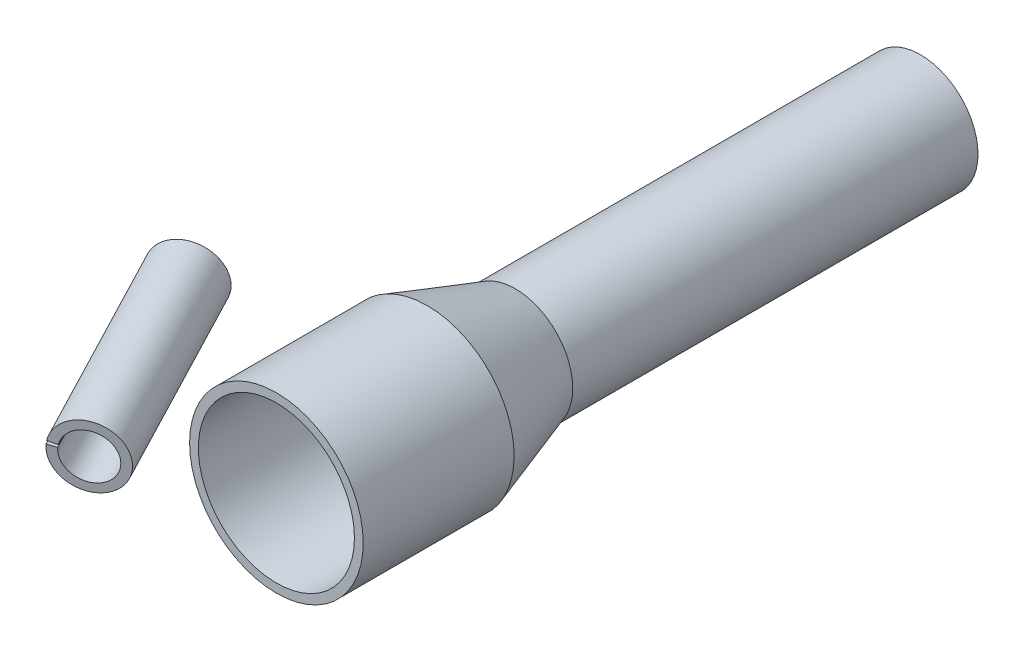
ISO-10303-21;
HEADER;
FILE_DESCRIPTION(('STEP AP214'),'2;1');
FILE_NAME('part.step','',(''),(''),'','','');
FILE_SCHEMA(('AUTOMOTIVE_DESIGN { 1 0 10303 214 1 1 1 1 }'));
ENDSEC;
DATA;
#1=APPLICATION_CONTEXT('core data for automotive mechanical design processes');
#2=APPLICATION_PROTOCOL_DEFINITION('international standard','automotive_design',2000,#1);
#3=PRODUCT_CONTEXT('',#1,'mechanical');
#4=PRODUCT('Part','Part','',(#3));
#5=PRODUCT_RELATED_PRODUCT_CATEGORY('part','',(#4));
#6=PRODUCT_DEFINITION_FORMATION('','',#4);
#7=PRODUCT_DEFINITION_CONTEXT('part definition',#1,'design');
#8=PRODUCT_DEFINITION('design','',#6,#7);
#9=PRODUCT_DEFINITION_SHAPE('','',#8);
#10=(LENGTH_UNIT() NAMED_UNIT(*) SI_UNIT(.MILLI.,.METRE.));
#11=(NAMED_UNIT(*) PLANE_ANGLE_UNIT() SI_UNIT($,.RADIAN.));
#12=(NAMED_UNIT(*) SI_UNIT($,.STERADIAN.) SOLID_ANGLE_UNIT());
#13=UNCERTAINTY_MEASURE_WITH_UNIT(LENGTH_MEASURE(1.E-05),#10,'distance_accuracy_value','');
#14=(GEOMETRIC_REPRESENTATION_CONTEXT(3) GLOBAL_UNCERTAINTY_ASSIGNED_CONTEXT((#13)) GLOBAL_UNIT_ASSIGNED_CONTEXT((#10,
#11,#12)) REPRESENTATION_CONTEXT('',''));
#15=CARTESIAN_POINT('',(0.,0.,0.));
#16=DIRECTION('',(0.,0.,1.));
#17=DIRECTION('',(1.,0.,0.));
#18=AXIS2_PLACEMENT_3D('',#15,#16,#17);
#19=CARTESIAN_POINT('',(0.,0.,51.3831032035715));
#20=DIRECTION('',(0.431711304054737,-0.0761223507816861,0.898794046299166));
#21=DIRECTION('',(0.901409499971671,0.,-0.432967566176523));
#22=AXIS2_PLACEMENT_3D('',#19,#20,#21);
#23=CYLINDRICAL_SURFACE('',#22,2.68999999999999);
#24=CARTESIAN_POINT('',(-22.4670726967806,3.96155109398092,4.60816127368262));
#25=DIRECTION('',(0.431711304054737,-0.0761223507816861,0.898794046299166));
#26=DIRECTION('',(0.901409499971671,0.,-0.432967566176523));
#27=AXIS2_PLACEMENT_3D('',#24,#25,#26);
#28=CIRCLE('',#27,2.68999999999998);
#29=CARTESIAN_POINT('',(-24.8692812602837,4.2421697388783,5.78576358073202));
#30=VERTEX_POINT('',#29);
#31=CARTESIAN_POINT('',(-24.8203875866409,4.51945954130341,5.78576358073202));
#32=VERTEX_POINT('',#31);
#33=EDGE_CURVE('E12',#30,#32,#28,.T.);
#34=ORIENTED_EDGE('',*,*,#33,.F.);
#35=DIRECTION('',(0.431711304054737,-0.0761223507816861,0.898794046299166));
#36=VECTOR('',#35,1.);
#37=CARTESIAN_POINT('',(-24.8692812602837,4.2421697388783,5.78576358073202));
#38=LINE('',#37,#36);
#39=CARTESIAN_POINT('',(-14.50820996297,2.41523332011783,27.356820691912));
#40=VERTEX_POINT('',#39);
#41=EDGE_CURVE('E84',#30,#40,#38,.T.);
#42=ORIENTED_EDGE('',*,*,#41,.T.);
#43=CARTESIAN_POINT('',(-12.1060013994669,2.13461467522045,26.1792183848626));
#44=DIRECTION('',(0.431711304054737,-0.0761223507816861,0.898794046299166));
#45=DIRECTION('',(0.901409499971671,0.,-0.432967566176523));
#46=AXIS2_PLACEMENT_3D('',#43,#44,#45);
#47=CIRCLE('',#46,2.69);
#48=CARTESIAN_POINT('',(-14.4593162893272,2.69252312254295,27.356820691912));
#49=VERTEX_POINT('',#48);
#50=EDGE_CURVE('E79',#40,#49,#47,.T.);
#51=ORIENTED_EDGE('',*,*,#50,.T.);
#52=DIRECTION('',(0.431711304054737,-0.0761223507816861,0.898794046299166));
#53=VECTOR('',#52,1.);
#54=CARTESIAN_POINT('',(-24.8203875866409,4.51945954130341,5.78576358073202));
#55=LINE('',#54,#53);
#56=EDGE_CURVE('E82',#32,#49,#55,.T.);
#57=ORIENTED_EDGE('',*,*,#56,.F.);
#58=EDGE_LOOP('',(#34,#42,#51,#57));
#59=FACE_BOUND('',#58,.T.);
#60=ADVANCED_FACE('F43',(#59),#23,.F.);
#61=CARTESIAN_POINT('',(-24.8692812602837,4.2421697388783,5.78576358073202));
#62=DIRECTION('',(0.431711304054737,-0.0761223507816861,0.898794046299166));
#63=DIRECTION('',(0.901409499971671,0.,-0.432967566176523));
#64=AXIS2_PLACEMENT_3D('',#61,#62,#63);
#65=PLANE('',#64);
#66=CARTESIAN_POINT('',(-22.4670726967806,3.96155109398092,4.60816127368262));
#67=DIRECTION('',(0.431711304054737,-0.0761223507816861,0.898794046299166));
#68=DIRECTION('',(0.901409499971671,0.,-0.432967566176523));
#69=AXIS2_PLACEMENT_3D('',#66,#67,#68);
#70=CIRCLE('',#69,3.69);
#71=CARTESIAN_POINT('',(-25.7622955961585,4.34648893772491,6.22353395509983));
#72=VERTEX_POINT('',#71);
#73=CARTESIAN_POINT('',(-25.6952258356596,4.72686045108872,6.22353395509983));
#74=VERTEX_POINT('',#73);
#75=EDGE_CURVE('E51',#72,#74,#70,.T.);
#76=ORIENTED_EDGE('',*,*,#75,.F.);
#77=DIRECTION('',(-0.893014335874779,0.104319198846609,0.437770374367807));
#78=VECTOR('',#77,1.);
#79=CARTESIAN_POINT('',(-24.8692812602837,4.2421697388783,5.78576358073202));
#80=LINE('',#79,#78);
#81=EDGE_CURVE('E89',#30,#72,#80,.T.);
#82=ORIENTED_EDGE('',*,*,#81,.F.);
#83=ORIENTED_EDGE('',*,*,#33,.T.);
#84=DIRECTION('',(-0.874838249018695,0.207400909785313,0.437770374367807));
#85=VECTOR('',#84,1.);
#86=CARTESIAN_POINT('',(-24.8203875866409,4.51945954130341,5.78576358073202));
#87=LINE('',#86,#85);
#88=EDGE_CURVE('E101',#32,#74,#87,.T.);
#89=ORIENTED_EDGE('',*,*,#88,.T.);
#90=EDGE_LOOP('',(#76,#82,#83,#89));
#91=FACE_BOUND('',#90,.T.);
#92=ADVANCED_FACE('F45',(#91),#65,.F.);
#93=CARTESIAN_POINT('',(0.,0.,51.3831032035715));
#94=DIRECTION('',(0.431711304054737,-0.0761223507816861,0.898794046299166));
#95=DIRECTION('',(0.901409499971671,0.,-0.432967566176523));
#96=AXIS2_PLACEMENT_3D('',#93,#94,#95);
#97=CYLINDRICAL_SURFACE('',#96,3.69);
#98=CARTESIAN_POINT('',(-12.1060013994669,2.13461467522045,26.1792183848626));
#99=DIRECTION('',(0.431711304054737,-0.0761223507816861,0.898794046299166));
#100=DIRECTION('',(0.901409499971671,0.,-0.432967566176523));
#101=AXIS2_PLACEMENT_3D('',#98,#99,#100);
#102=CIRCLE('',#101,3.69);
#103=CARTESIAN_POINT('',(-15.4012242988448,2.51955251896444,27.7945910662798));
#104=VERTEX_POINT('',#103);
#105=CARTESIAN_POINT('',(-15.3341545383459,2.89992403232826,27.7945910662798));
#106=VERTEX_POINT('',#105);
#107=EDGE_CURVE('E88',#104,#106,#102,.T.);
#108=ORIENTED_EDGE('',*,*,#107,.F.);
#109=DIRECTION('',(0.431711304054737,-0.0761223507816861,0.898794046299166));
#110=VECTOR('',#109,1.);
#111=CARTESIAN_POINT('',(-25.7622955961585,4.34648893772491,6.22353395509983));
#112=LINE('',#111,#110);
#113=EDGE_CURVE('E109',#72,#104,#112,.T.);
#114=ORIENTED_EDGE('',*,*,#113,.F.);
#115=ORIENTED_EDGE('',*,*,#75,.T.);
#116=DIRECTION('',(0.431711304054737,-0.0761223507816861,0.898794046299167));
#117=VECTOR('',#116,1.);
#118=CARTESIAN_POINT('',(-25.6952258356596,4.72686045108872,6.22353395509983));
#119=LINE('',#118,#117);
#120=EDGE_CURVE('E97',#74,#106,#119,.T.);
#121=ORIENTED_EDGE('',*,*,#120,.T.);
#122=EDGE_LOOP('',(#108,#114,#115,#121));
#123=FACE_BOUND('',#122,.T.);
#124=ADVANCED_FACE('F115',(#123),#97,.T.);
#125=CARTESIAN_POINT('',(-15.4012242988448,2.51955251896444,27.7945910662798));
#126=DIRECTION('',(-0.431711304054737,0.0761223507816861,-0.898794046299166));
#127=DIRECTION('',(-0.901409499971671,0.,0.432967566176523));
#128=AXIS2_PLACEMENT_3D('',#125,#126,#127);
#129=PLANE('',#128);
#130=DIRECTION('',(0.893014335874774,-0.104319198846608,-0.437770374367817));
#131=VECTOR('',#130,1.);
#132=CARTESIAN_POINT('',(-15.4012242988448,2.51955251896444,27.7945910662798));
#133=LINE('',#132,#131);
#134=EDGE_CURVE('E107',#104,#40,#133,.T.);
#135=ORIENTED_EDGE('',*,*,#134,.F.);
#136=ORIENTED_EDGE('',*,*,#107,.T.);
#137=DIRECTION('',(0.87483824901869,-0.207400909785312,-0.437770374367817));
#138=VECTOR('',#137,1.);
#139=CARTESIAN_POINT('',(-15.3341545383459,2.89992403232826,27.7945910662798));
#140=LINE('',#139,#138);
#141=EDGE_CURVE('E92',#106,#49,#140,.T.);
#142=ORIENTED_EDGE('',*,*,#141,.T.);
#143=ORIENTED_EDGE('',*,*,#50,.F.);
#144=EDGE_LOOP('',(#135,#136,#142,#143));
#145=FACE_BOUND('',#144,.T.);
#146=ADVANCED_FACE('F93',(#145),#129,.F.);
#147=CARTESIAN_POINT('',(-40.0526802864188,5.86532175491951,19.7349737578354));
#148=DIRECTION('',(0.127085584837487,0.991626387538912,0.0229425731565194));
#149=DIRECTION('',(0.779491268320961,-0.114148842503382,0.615924836620928));
#150=AXIS2_PLACEMENT_3D('',#147,#148,#149);
#151=PLANE('',#150);
#152=ORIENTED_EDGE('',*,*,#41,.F.);
#153=ORIENTED_EDGE('',*,*,#81,.T.);
#154=ORIENTED_EDGE('',*,*,#113,.T.);
#155=ORIENTED_EDGE('',*,*,#134,.T.);
#156=EDGE_LOOP('',(#152,#153,#154,#155));
#157=FACE_BOUND('',#156,.T.);
#158=ADVANCED_FACE('F117',(#157),#151,.T.);
#159=CARTESIAN_POINT('',(-39.6432662951137,8.18722388050526,19.7349737578354));
#160=DIRECTION('',(0.219734812911526,0.975289828887646,-0.0229425731565194));
#161=DIRECTION('',(0.771523396281722,-0.159336890340562,0.615924836620928));
#162=AXIS2_PLACEMENT_3D('',#159,#160,#161);
#163=PLANE('',#162);
#164=ORIENTED_EDGE('',*,*,#56,.T.);
#165=ORIENTED_EDGE('',*,*,#141,.F.);
#166=ORIENTED_EDGE('',*,*,#120,.F.);
#167=ORIENTED_EDGE('',*,*,#88,.F.);
#168=EDGE_LOOP('',(#164,#165,#166,#167));
#169=FACE_BOUND('',#168,.T.);
#170=ADVANCED_FACE('F100',(#169),#163,.F.);
#171=CLOSED_SHELL('',(#60,#92,#124,#146,#158,#170));
#172=MANIFOLD_SOLID_BREP('B2',#171);
#173=CARTESIAN_POINT('',(0.,0.,-83.5827742070717));
#174=DIRECTION('',(0.,0.,1.));
#175=DIRECTION('',(1.,0.,0.));
#176=AXIS2_PLACEMENT_3D('',#173,#174,#175);
#177=CYLINDRICAL_SURFACE('',#176,9.87499999999999);
#178=CARTESIAN_POINT('',(0.,0.,17.));
#179=DIRECTION('',(0.,0.,1.));
#180=DIRECTION('',(1.,0.,0.));
#181=AXIS2_PLACEMENT_3D('',#178,#179,#180);
#182=CIRCLE('',#181,9.87499999999999);
#183=CARTESIAN_POINT('',(9.87499999999999,0.,17.));
#184=VERTEX_POINT('',#183);
#185=EDGE_CURVE('E195',#184,#184,#182,.T.);
#186=ORIENTED_EDGE('',*,*,#185,.F.);
#187=EDGE_LOOP('',(#186));
#188=FACE_BOUND('',#187,.T.);
#189=CARTESIAN_POINT('',(0.,0.,-0.162354632309084));
#190=DIRECTION('',(0.,0.,1.));
#191=DIRECTION('',(1.,0.,0.));
#192=AXIS2_PLACEMENT_3D('',#189,#190,#191);
#193=CIRCLE('',#192,9.87499999999999);
#194=CARTESIAN_POINT('',(9.87499999999999,0.,-0.162354632309084));
#195=VERTEX_POINT('',#194);
#196=EDGE_CURVE('E42',#195,#195,#193,.T.);
#197=ORIENTED_EDGE('',*,*,#196,.T.);
#198=EDGE_LOOP('',(#197));
#199=FACE_BOUND('',#198,.T.);
#200=ADVANCED_FACE('F167',(#188,#199),#177,.T.);
#201=CARTESIAN_POINT('',(0.,0.,-10.1623546323091));
#202=DIRECTION('',(0.,0.,1.));
#203=DIRECTION('',(1.,0.,0.));
#204=AXIS2_PLACEMENT_3D('',#201,#202,#203);
#205=CONICAL_SURFACE('',#204,6.53999999999999,0.321900546895892);
#206=ORIENTED_EDGE('',*,*,#196,.F.);
#207=EDGE_LOOP('',(#206));
#208=FACE_BOUND('',#207,.T.);
#209=CARTESIAN_POINT('',(0.,0.,-10.1623546323091));
#210=DIRECTION('',(0.,0.,1.));
#211=DIRECTION('',(1.,0.,0.));
#212=AXIS2_PLACEMENT_3D('',#209,#210,#211);
#213=CIRCLE('',#212,6.53999999999999);
#214=CARTESIAN_POINT('',(6.53999999999999,0.,-10.1623546323091));
#215=VERTEX_POINT('',#214);
#216=EDGE_CURVE('E173',#215,#215,#213,.T.);
#217=ORIENTED_EDGE('',*,*,#216,.T.);
#218=EDGE_LOOP('',(#217));
#219=FACE_BOUND('',#218,.T.);
#220=ADVANCED_FACE('F203',(#208,#219),#205,.T.);
#221=CARTESIAN_POINT('',(0.,0.,-83.5827742070717));
#222=DIRECTION('',(0.,0.,1.));
#223=DIRECTION('',(1.,0.,0.));
#224=AXIS2_PLACEMENT_3D('',#221,#222,#223);
#225=CYLINDRICAL_SURFACE('',#224,6.53999999999999);
#226=ORIENTED_EDGE('',*,*,#216,.F.);
#227=EDGE_LOOP('',(#226));
#228=FACE_BOUND('',#227,.T.);
#229=CARTESIAN_POINT('',(0.,0.,-56.26));
#230=DIRECTION('',(0.,0.,1.));
#231=DIRECTION('',(1.,0.,0.));
#232=AXIS2_PLACEMENT_3D('',#229,#230,#231);
#233=CIRCLE('',#232,6.53999999999999);
#234=CARTESIAN_POINT('',(6.53999999999999,0.,-56.26));
#235=VERTEX_POINT('',#234);
#236=EDGE_CURVE('E177',#235,#235,#233,.T.);
#237=ORIENTED_EDGE('',*,*,#236,.T.);
#238=EDGE_LOOP('',(#237));
#239=FACE_BOUND('',#238,.T.);
#240=ADVANCED_FACE('F207',(#228,#239),#225,.T.);
#241=CARTESIAN_POINT('',(0.,6.53999999999999,-56.26));
#242=DIRECTION('',(0.,0.,-1.));
#243=DIRECTION('',(-1.,0.,0.));
#244=AXIS2_PLACEMENT_3D('',#241,#242,#243);
#245=PLANE('',#244);
#246=CARTESIAN_POINT('',(0.,0.,-56.26));
#247=DIRECTION('',(0.,0.,1.));
#248=DIRECTION('',(1.,0.,0.));
#249=AXIS2_PLACEMENT_3D('',#246,#247,#248);
#250=CIRCLE('',#249,5.53999999999999);
#251=CARTESIAN_POINT('',(5.53999999999999,0.,-56.26));
#252=VERTEX_POINT('',#251);
#253=EDGE_CURVE('E181',#252,#252,#250,.T.);
#254=ORIENTED_EDGE('',*,*,#253,.T.);
#255=EDGE_LOOP('',(#254));
#256=FACE_BOUND('',#255,.T.);
#257=ORIENTED_EDGE('',*,*,#236,.F.);
#258=EDGE_LOOP('',(#257));
#259=FACE_BOUND('',#258,.T.);
#260=ADVANCED_FACE('F212',(#256,#259),#245,.T.);
#261=CARTESIAN_POINT('',(0.,0.,-83.5827742070717));
#262=DIRECTION('',(0.,0.,1.));
#263=DIRECTION('',(1.,0.,0.));
#264=AXIS2_PLACEMENT_3D('',#261,#262,#263);
#265=CYLINDRICAL_SURFACE('',#264,5.53999999999999);
#266=CARTESIAN_POINT('',(0.,0.,-10.));
#267=DIRECTION('',(0.,0.,1.));
#268=DIRECTION('',(1.,0.,0.));
#269=AXIS2_PLACEMENT_3D('',#266,#267,#268);
#270=CIRCLE('',#269,5.53999999999999);
#271=CARTESIAN_POINT('',(5.53999999999999,0.,-10.));
#272=VERTEX_POINT('',#271);
#273=EDGE_CURVE('E186',#272,#272,#270,.T.);
#274=ORIENTED_EDGE('',*,*,#273,.T.);
#275=EDGE_LOOP('',(#274));
#276=FACE_BOUND('',#275,.T.);
#277=ORIENTED_EDGE('',*,*,#253,.F.);
#278=EDGE_LOOP('',(#277));
#279=FACE_BOUND('',#278,.T.);
#280=ADVANCED_FACE('F218',(#276,#279),#265,.F.);
#281=CARTESIAN_POINT('',(0.,0.,-10.));
#282=DIRECTION('',(0.,0.,1.));
#283=DIRECTION('',(1.,0.,0.));
#284=AXIS2_PLACEMENT_3D('',#281,#282,#283);
#285=CONICAL_SURFACE('',#284,5.53999999999999,0.321900546895892);
#286=CARTESIAN_POINT('',(0.,0.,0.));
#287=DIRECTION('',(0.,0.,1.));
#288=DIRECTION('',(1.,0.,0.));
#289=AXIS2_PLACEMENT_3D('',#286,#287,#288);
#290=CIRCLE('',#289,8.87499999999999);
#291=CARTESIAN_POINT('',(8.87499999999999,0.,0.));
#292=VERTEX_POINT('',#291);
#293=EDGE_CURVE('E189',#292,#292,#290,.T.);
#294=ORIENTED_EDGE('',*,*,#293,.T.);
#295=EDGE_LOOP('',(#294));
#296=FACE_BOUND('',#295,.T.);
#297=ORIENTED_EDGE('',*,*,#273,.F.);
#298=EDGE_LOOP('',(#297));
#299=FACE_BOUND('',#298,.T.);
#300=ADVANCED_FACE('F222',(#296,#299),#285,.F.);
#301=CARTESIAN_POINT('',(0.,0.,-83.5827742070717));
#302=DIRECTION('',(0.,0.,1.));
#303=DIRECTION('',(1.,0.,0.));
#304=AXIS2_PLACEMENT_3D('',#301,#302,#303);
#305=CYLINDRICAL_SURFACE('',#304,8.87499999999999);
#306=CARTESIAN_POINT('',(0.,0.,17.));
#307=DIRECTION('',(0.,0.,1.));
#308=DIRECTION('',(1.,0.,0.));
#309=AXIS2_PLACEMENT_3D('',#306,#307,#308);
#310=CIRCLE('',#309,8.87499999999999);
#311=CARTESIAN_POINT('',(8.87499999999999,0.,17.));
#312=VERTEX_POINT('',#311);
#313=EDGE_CURVE('E192',#312,#312,#310,.T.);
#314=ORIENTED_EDGE('',*,*,#313,.T.);
#315=EDGE_LOOP('',(#314));
#316=FACE_BOUND('',#315,.T.);
#317=ORIENTED_EDGE('',*,*,#293,.F.);
#318=EDGE_LOOP('',(#317));
#319=FACE_BOUND('',#318,.T.);
#320=ADVANCED_FACE('F226',(#316,#319),#305,.F.);
#321=CARTESIAN_POINT('',(0.,8.87499999999999,17.));
#322=DIRECTION('',(0.,0.,1.));
#323=DIRECTION('',(1.,0.,0.));
#324=AXIS2_PLACEMENT_3D('',#321,#322,#323);
#325=PLANE('',#324);
#326=ORIENTED_EDGE('',*,*,#185,.T.);
#327=EDGE_LOOP('',(#326));
#328=FACE_BOUND('',#327,.T.);
#329=ORIENTED_EDGE('',*,*,#313,.F.);
#330=EDGE_LOOP('',(#329));
#331=FACE_BOUND('',#330,.T.);
#332=ADVANCED_FACE('F199',(#328,#331),#325,.T.);
#333=CLOSED_SHELL('',(#200,#220,#240,#260,#280,#300,#320,#332));
#334=MANIFOLD_SOLID_BREP('B6',#333);
#335=ADVANCED_BREP_SHAPE_REPRESENTATION('',(#18,#172,#334),#14);
#336=SHAPE_DEFINITION_REPRESENTATION(#9,#335);
ENDSEC;
END-ISO-10303-21;
